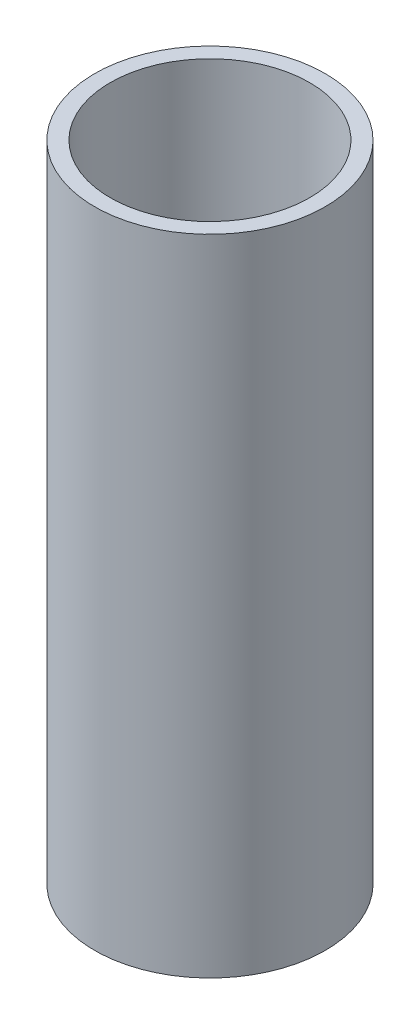
ISO-10303-21;
HEADER;
FILE_DESCRIPTION(('STEP AP214'),'2;1');
FILE_NAME('part.step','',(''),(''),'','','');
FILE_SCHEMA(('AUTOMOTIVE_DESIGN { 1 0 10303 214 1 1 1 1 }'));
ENDSEC;
DATA;
#1=APPLICATION_CONTEXT('core data for automotive mechanical design processes');
#2=APPLICATION_PROTOCOL_DEFINITION('international standard','automotive_design',2000,#1);
#3=PRODUCT_CONTEXT('',#1,'mechanical');
#4=PRODUCT('Part','Part','',(#3));
#5=PRODUCT_RELATED_PRODUCT_CATEGORY('part','',(#4));
#6=PRODUCT_DEFINITION_FORMATION('','',#4);
#7=PRODUCT_DEFINITION_CONTEXT('part definition',#1,'design');
#8=PRODUCT_DEFINITION('design','',#6,#7);
#9=PRODUCT_DEFINITION_SHAPE('','',#8);
#10=(LENGTH_UNIT() NAMED_UNIT(*) SI_UNIT(.MILLI.,.METRE.));
#11=(NAMED_UNIT(*) PLANE_ANGLE_UNIT() SI_UNIT($,.RADIAN.));
#12=(NAMED_UNIT(*) SI_UNIT($,.STERADIAN.) SOLID_ANGLE_UNIT());
#13=UNCERTAINTY_MEASURE_WITH_UNIT(LENGTH_MEASURE(1.E-05),#10,'distance_accuracy_value','');
#14=(GEOMETRIC_REPRESENTATION_CONTEXT(3) GLOBAL_UNCERTAINTY_ASSIGNED_CONTEXT((#13)) GLOBAL_UNIT_ASSIGNED_CONTEXT((#10,
#11,#12)) REPRESENTATION_CONTEXT('',''));
#15=CARTESIAN_POINT('',(0.,0.,0.));
#16=DIRECTION('',(0.,0.,1.));
#17=DIRECTION('',(1.,0.,0.));
#18=AXIS2_PLACEMENT_3D('',#15,#16,#17);
#19=CARTESIAN_POINT('',(0.,237.349167838291,0.));
#20=DIRECTION('',(0.,-1.,0.));
#21=DIRECTION('',(0.,0.,-1.));
#22=AXIS2_PLACEMENT_3D('',#19,#20,#21);
#23=CYLINDRICAL_SURFACE('',#22,42.5);
#24=CARTESIAN_POINT('',(0.,237.349167838291,0.));
#25=DIRECTION('',(0.,1.,0.));
#26=DIRECTION('',(0.,0.,1.));
#27=AXIS2_PLACEMENT_3D('',#24,#25,#26);
#28=CIRCLE('',#27,42.5);
#29=CARTESIAN_POINT('',(0.,237.34916783829,-42.5));
#30=VERTEX_POINT('',#29);
#31=EDGE_CURVE('E10',#30,#30,#28,.T.);
#32=CARTESIAN_POINT('',(0.,0.,0.));
#33=DIRECTION('',(0.,1.,0.));
#34=DIRECTION('',(0.,0.,1.));
#35=AXIS2_PLACEMENT_3D('',#32,#33,#34);
#36=CIRCLE('',#35,42.5);
#37=CARTESIAN_POINT('',(0.,0.,-42.5));
#38=VERTEX_POINT('',#37);
#39=EDGE_CURVE('E37',#38,#38,#36,.T.);
#40=CARTESIAN_POINT('',(0.,237.34916783829,-42.5));
#41=CARTESIAN_POINT('',(0.,234.876780673308,-42.5));
#42=CARTESIAN_POINT('',(0.,232.404393508326,-42.5));
#43=CARTESIAN_POINT('',(0.,227.459619178362,-42.5));
#44=CARTESIAN_POINT('',(0.,224.98723201338,-42.5));
#45=CARTESIAN_POINT('',(0.,220.042457683415,-42.5));
#46=CARTESIAN_POINT('',(0.,217.570070518433,-42.5));
#47=CARTESIAN_POINT('',(0.,212.625296188469,-42.5));
#48=CARTESIAN_POINT('',(0.,210.152909023486,-42.5));
#49=CARTESIAN_POINT('',(0.,205.208134693522,-42.5));
#50=CARTESIAN_POINT('',(0.,202.73574752854,-42.5));
#51=CARTESIAN_POINT('',(0.,197.790973198575,-42.5));
#52=CARTESIAN_POINT('',(0.,195.318586033593,-42.5));
#53=CARTESIAN_POINT('',(0.,190.373811703629,-42.5));
#54=CARTESIAN_POINT('',(0.,187.901424538647,-42.5));
#55=CARTESIAN_POINT('',(0.,182.956650208682,-42.5));
#56=CARTESIAN_POINT('',(0.,180.4842630437,-42.5));
#57=CARTESIAN_POINT('',(0.,175.539488713736,-42.5));
#58=CARTESIAN_POINT('',(0.,173.067101548753,-42.5));
#59=CARTESIAN_POINT('',(0.,168.122327218789,-42.5));
#60=CARTESIAN_POINT('',(0.,165.649940053807,-42.5));
#61=CARTESIAN_POINT('',(0.,160.705165723843,-42.5));
#62=CARTESIAN_POINT('',(0.,158.23277855886,-42.5));
#63=CARTESIAN_POINT('',(0.,153.288004228896,-42.5));
#64=CARTESIAN_POINT('',(0.,150.815617063914,-42.5));
#65=CARTESIAN_POINT('',(0.,145.870842733949,-42.5));
#66=CARTESIAN_POINT('',(0.,143.398455568967,-42.5));
#67=CARTESIAN_POINT('',(0.,138.453681239003,-42.5));
#68=CARTESIAN_POINT('',(0.,135.981294074021,-42.5));
#69=CARTESIAN_POINT('',(0.,131.036519744056,-42.5));
#70=CARTESIAN_POINT('',(0.,128.564132579074,-42.5));
#71=CARTESIAN_POINT('',(0.,123.61935824911,-42.5));
#72=CARTESIAN_POINT('',(0.,121.146971084127,-42.5));
#73=CARTESIAN_POINT('',(0.,116.202196754163,-42.5));
#74=CARTESIAN_POINT('',(0.,113.729809589181,-42.5));
#75=CARTESIAN_POINT('',(0.,108.785035259216,-42.5));
#76=CARTESIAN_POINT('',(0.,106.312648094234,-42.5));
#77=CARTESIAN_POINT('',(0.,101.36787376427,-42.5));
#78=CARTESIAN_POINT('',(0.,98.8954865992877,-42.5));
#79=CARTESIAN_POINT('',(0.,93.9507122693233,-42.5));
#80=CARTESIAN_POINT('',(0.,91.4783251043411,-42.5));
#81=CARTESIAN_POINT('',(0.,86.5335507743767,-42.5));
#82=CARTESIAN_POINT('',(0.,84.0611636093945,-42.5));
#83=CARTESIAN_POINT('',(0.,79.1163892794302,-42.5));
#84=CARTESIAN_POINT('',(0.,76.644002114448,-42.5));
#85=CARTESIAN_POINT('',(0.,71.6992277844836,-42.5));
#86=CARTESIAN_POINT('',(0.,69.2268406195014,-42.5));
#87=CARTESIAN_POINT('',(0.,64.282066289537,-42.5));
#88=CARTESIAN_POINT('',(0.,61.8096791245548,-42.5));
#89=CARTESIAN_POINT('',(0.,56.8649047945904,-42.5));
#90=CARTESIAN_POINT('',(0.,54.3925176296082,-42.5));
#91=CARTESIAN_POINT('',(0.,49.4477432996438,-42.5));
#92=CARTESIAN_POINT('',(0.,46.9753561346616,-42.5));
#93=CARTESIAN_POINT('',(0.,42.0305818046973,-42.5));
#94=CARTESIAN_POINT('',(0.,39.5581946397151,-42.5));
#95=CARTESIAN_POINT('',(0.,34.6134203097507,-42.5));
#96=CARTESIAN_POINT('',(0.,32.1410331447685,-42.5));
#97=CARTESIAN_POINT('',(0.,27.1962588148041,-42.5));
#98=CARTESIAN_POINT('',(0.,24.7238716498219,-42.5));
#99=CARTESIAN_POINT('',(0.,19.7790973198575,-42.5));
#100=CARTESIAN_POINT('',(0.,17.3067101548753,-42.5));
#101=CARTESIAN_POINT('',(0.,12.3619358249109,-42.5));
#102=CARTESIAN_POINT('',(0.,9.88954865992875,-42.5));
#103=CARTESIAN_POINT('',(0.,4.94477432996436,-42.5));
#104=CARTESIAN_POINT('',(0.,2.47238716498217,-42.5));
#105=CARTESIAN_POINT('',(0.,0.,-42.5));
#106=B_SPLINE_CURVE_WITH_KNOTS('',3,(#40,#41,#42,#43,#44,#45,#46,#47,#48,#49,#50,#51,#52,#53,
#54,#55,#56,#57,#58,#59,#60,#61,#62,#63,#64,#65,#66,#67,#68,#69,#70,#71,#72,#73,#74,#75,#76,#77,
#78,#79,#80,#81,#82,#83,#84,#85,#86,#87,#88,#89,#90,#91,#92,#93,#94,#95,#96,#97,#98,#99,#100,
#101,#102,#103,#104,#105),.UNSPECIFIED.,.F.,.F.,(4,2,2,2,2,2,2,2,2,2,2,2,2,2,2,2,2,2,2,2,2,2,2,
2,2,2,2,2,2,2,2,2,4),(0.,7.41716149494656,14.8343229898932,22.2514844848397,29.6686459797863,
37.0858074747329,44.5029689696795,51.920130464626,59.3372919595726,66.7544534545192,
74.1716149494657,81.5887764444123,89.0059379393589,96.4230994343055,103.840260929252,
111.257422424199,118.674583919145,126.091745414092,133.508906909038,140.926068403985,
148.343229898932,155.760391393878,163.177552888825,170.594714383771,178.011875878718,
185.429037373664,192.846198868611,200.263360363558,207.680521858504,215.097683353451,
222.514844848397,229.932006343344,237.349167838291),.UNSPECIFIED.);
#107=EDGE_CURVE('BSEAM40',#30,#38,#106,.T.);
#108=ORIENTED_EDGE('',*,*,#31,.F.);
#109=ORIENTED_EDGE('',*,*,#39,.T.);
#110=ORIENTED_EDGE('',*,*,#107,.T.);
#111=ORIENTED_EDGE('',*,*,#107,.F.);
#112=EDGE_LOOP('',(#108,#110,#109,#111));
#113=FACE_BOUND('',#112,.T.);
#114=ADVANCED_FACE('F40',(#113),#23,.T.);
#115=CARTESIAN_POINT('',(0.,237.349167838291,0.));
#116=DIRECTION('',(0.,1.,0.));
#117=DIRECTION('',(0.,0.,1.));
#118=AXIS2_PLACEMENT_3D('',#115,#116,#117);
#119=PLANE('',#118);
#120=CARTESIAN_POINT('',(0.,237.349167838291,0.));
#121=DIRECTION('',(0.,1.,0.));
#122=DIRECTION('',(0.,0.,1.));
#123=AXIS2_PLACEMENT_3D('',#120,#121,#122);
#124=CIRCLE('',#123,36.7560137630562);
#125=CARTESIAN_POINT('',(0.,237.34916783829,-36.7560137630562));
#126=VERTEX_POINT('',#125);
#127=EDGE_CURVE('E50',#126,#126,#124,.T.);
#128=ORIENTED_EDGE('',*,*,#127,.F.);
#129=EDGE_LOOP('',(#128));
#130=FACE_BOUND('',#129,.T.);
#131=ORIENTED_EDGE('',*,*,#31,.T.);
#132=EDGE_LOOP('',(#131));
#133=FACE_BOUND('',#132,.T.);
#134=ADVANCED_FACE('F59',(#130,#133),#119,.T.);
#135=CARTESIAN_POINT('',(0.,0.,0.));
#136=DIRECTION('',(0.,1.,0.));
#137=DIRECTION('',(0.,0.,1.));
#138=AXIS2_PLACEMENT_3D('',#135,#136,#137);
#139=PLANE('',#138);
#140=CARTESIAN_POINT('',(0.,0.,0.));
#141=DIRECTION('',(0.,1.,0.));
#142=DIRECTION('',(0.,0.,1.));
#143=AXIS2_PLACEMENT_3D('',#140,#141,#142);
#144=CIRCLE('',#143,36.7560137630562);
#145=CARTESIAN_POINT('',(0.,0.,-36.7560137630562));
#146=VERTEX_POINT('',#145);
#147=EDGE_CURVE('E47',#146,#146,#144,.T.);
#148=ORIENTED_EDGE('',*,*,#147,.T.);
#149=EDGE_LOOP('',(#148));
#150=FACE_BOUND('',#149,.T.);
#151=ORIENTED_EDGE('',*,*,#39,.F.);
#152=EDGE_LOOP('',(#151));
#153=FACE_BOUND('',#152,.T.);
#154=ADVANCED_FACE('F58',(#150,#153),#139,.F.);
#155=CARTESIAN_POINT('',(0.,237.349167838291,0.));
#156=DIRECTION('',(0.,-1.,0.));
#157=DIRECTION('',(0.,0.,-1.));
#158=AXIS2_PLACEMENT_3D('',#155,#156,#157);
#159=CYLINDRICAL_SURFACE('',#158,36.7560137630562);
#160=CARTESIAN_POINT('',(0.,237.34916783829,-36.7560137630562));
#161=CARTESIAN_POINT('',(0.,234.876780673308,-36.7560137630562));
#162=CARTESIAN_POINT('',(0.,232.404393508326,-36.7560137630562));
#163=CARTESIAN_POINT('',(0.,227.459619178362,-36.7560137630562));
#164=CARTESIAN_POINT('',(0.,224.98723201338,-36.7560137630562));
#165=CARTESIAN_POINT('',(0.,220.042457683415,-36.7560137630562));
#166=CARTESIAN_POINT('',(0.,217.570070518433,-36.7560137630562));
#167=CARTESIAN_POINT('',(0.,212.625296188469,-36.7560137630562));
#168=CARTESIAN_POINT('',(0.,210.152909023486,-36.7560137630562));
#169=CARTESIAN_POINT('',(0.,205.208134693522,-36.7560137630562));
#170=CARTESIAN_POINT('',(0.,202.73574752854,-36.7560137630562));
#171=CARTESIAN_POINT('',(0.,197.790973198575,-36.7560137630562));
#172=CARTESIAN_POINT('',(0.,195.318586033593,-36.7560137630562));
#173=CARTESIAN_POINT('',(0.,190.373811703629,-36.7560137630562));
#174=CARTESIAN_POINT('',(0.,187.901424538647,-36.7560137630562));
#175=CARTESIAN_POINT('',(0.,182.956650208682,-36.7560137630562));
#176=CARTESIAN_POINT('',(0.,180.4842630437,-36.7560137630562));
#177=CARTESIAN_POINT('',(0.,175.539488713736,-36.7560137630562));
#178=CARTESIAN_POINT('',(0.,173.067101548753,-36.7560137630562));
#179=CARTESIAN_POINT('',(0.,168.122327218789,-36.7560137630562));
#180=CARTESIAN_POINT('',(0.,165.649940053807,-36.7560137630562));
#181=CARTESIAN_POINT('',(0.,160.705165723843,-36.7560137630562));
#182=CARTESIAN_POINT('',(0.,158.23277855886,-36.7560137630562));
#183=CARTESIAN_POINT('',(0.,153.288004228896,-36.7560137630562));
#184=CARTESIAN_POINT('',(0.,150.815617063914,-36.7560137630562));
#185=CARTESIAN_POINT('',(0.,145.870842733949,-36.7560137630562));
#186=CARTESIAN_POINT('',(0.,143.398455568967,-36.7560137630562));
#187=CARTESIAN_POINT('',(0.,138.453681239003,-36.7560137630562));
#188=CARTESIAN_POINT('',(0.,135.981294074021,-36.7560137630562));
#189=CARTESIAN_POINT('',(0.,131.036519744056,-36.7560137630562));
#190=CARTESIAN_POINT('',(0.,128.564132579074,-36.7560137630562));
#191=CARTESIAN_POINT('',(0.,123.61935824911,-36.7560137630562));
#192=CARTESIAN_POINT('',(0.,121.146971084127,-36.7560137630562));
#193=CARTESIAN_POINT('',(0.,116.202196754163,-36.7560137630562));
#194=CARTESIAN_POINT('',(0.,113.729809589181,-36.7560137630562));
#195=CARTESIAN_POINT('',(0.,108.785035259216,-36.7560137630562));
#196=CARTESIAN_POINT('',(0.,106.312648094234,-36.7560137630562));
#197=CARTESIAN_POINT('',(0.,101.36787376427,-36.7560137630562));
#198=CARTESIAN_POINT('',(0.,98.8954865992877,-36.7560137630562));
#199=CARTESIAN_POINT('',(0.,93.9507122693233,-36.7560137630562));
#200=CARTESIAN_POINT('',(0.,91.4783251043411,-36.7560137630562));
#201=CARTESIAN_POINT('',(0.,86.5335507743767,-36.7560137630562));
#202=CARTESIAN_POINT('',(0.,84.0611636093945,-36.7560137630562));
#203=CARTESIAN_POINT('',(0.,79.1163892794302,-36.7560137630562));
#204=CARTESIAN_POINT('',(0.,76.644002114448,-36.7560137630562));
#205=CARTESIAN_POINT('',(0.,71.6992277844836,-36.7560137630562));
#206=CARTESIAN_POINT('',(0.,69.2268406195014,-36.7560137630562));
#207=CARTESIAN_POINT('',(0.,64.282066289537,-36.7560137630562));
#208=CARTESIAN_POINT('',(0.,61.8096791245548,-36.7560137630562));
#209=CARTESIAN_POINT('',(0.,56.8649047945904,-36.7560137630562));
#210=CARTESIAN_POINT('',(0.,54.3925176296082,-36.7560137630562));
#211=CARTESIAN_POINT('',(0.,49.4477432996438,-36.7560137630562));
#212=CARTESIAN_POINT('',(0.,46.9753561346616,-36.7560137630562));
#213=CARTESIAN_POINT('',(0.,42.0305818046973,-36.7560137630562));
#214=CARTESIAN_POINT('',(0.,39.5581946397151,-36.7560137630562));
#215=CARTESIAN_POINT('',(0.,34.6134203097507,-36.7560137630562));
#216=CARTESIAN_POINT('',(0.,32.1410331447685,-36.7560137630562));
#217=CARTESIAN_POINT('',(0.,27.1962588148041,-36.7560137630562));
#218=CARTESIAN_POINT('',(0.,24.7238716498219,-36.7560137630562));
#219=CARTESIAN_POINT('',(0.,19.7790973198575,-36.7560137630562));
#220=CARTESIAN_POINT('',(0.,17.3067101548753,-36.7560137630562));
#221=CARTESIAN_POINT('',(0.,12.3619358249109,-36.7560137630562));
#222=CARTESIAN_POINT('',(0.,9.88954865992875,-36.7560137630562));
#223=CARTESIAN_POINT('',(0.,4.94477432996436,-36.7560137630562));
#224=CARTESIAN_POINT('',(0.,2.47238716498217,-36.7560137630562));
#225=CARTESIAN_POINT('',(0.,0.,-36.7560137630562));
#226=B_SPLINE_CURVE_WITH_KNOTS('',3,(#160,#161,#162,#163,#164,#165,#166,#167,#168,#169,#170,
#171,#172,#173,#174,#175,#176,#177,#178,#179,#180,#181,#182,#183,#184,#185,#186,#187,#188,#189,
#190,#191,#192,#193,#194,#195,#196,#197,#198,#199,#200,#201,#202,#203,#204,#205,#206,#207,#208,
#209,#210,#211,#212,#213,#214,#215,#216,#217,#218,#219,#220,#221,#222,#223,#224,#225),
.UNSPECIFIED.,.F.,.F.,(4,2,2,2,2,2,2,2,2,2,2,2,2,2,2,2,2,2,2,2,2,2,2,2,2,2,2,2,2,2,2,2,4),(0.,
7.41716149494656,14.8343229898932,22.2514844848397,29.6686459797863,37.0858074747329,
44.5029689696795,51.920130464626,59.3372919595726,66.7544534545192,74.1716149494657,
81.5887764444123,89.0059379393589,96.4230994343055,103.840260929252,111.257422424199,
118.674583919145,126.091745414092,133.508906909038,140.926068403985,148.343229898932,
155.760391393878,163.177552888825,170.594714383771,178.011875878718,185.429037373664,
192.846198868611,200.263360363558,207.680521858504,215.097683353451,222.514844848397,
229.932006343344,237.349167838291),.UNSPECIFIED.);
#227=EDGE_CURVE('BSEAM54',#126,#146,#226,.T.);
#228=ORIENTED_EDGE('',*,*,#127,.T.);
#229=ORIENTED_EDGE('',*,*,#147,.F.);
#230=ORIENTED_EDGE('',*,*,#227,.T.);
#231=ORIENTED_EDGE('',*,*,#227,.F.);
#232=EDGE_LOOP('',(#228,#230,#229,#231));
#233=FACE_BOUND('',#232,.T.);
#234=ADVANCED_FACE('F54',(#233),#159,.F.);
#235=CLOSED_SHELL('',(#114,#134,#154,#234));
#236=MANIFOLD_SOLID_BREP('B2',#235);
#237=ADVANCED_BREP_SHAPE_REPRESENTATION('',(#18,#236),#14);
#238=SHAPE_DEFINITION_REPRESENTATION(#9,#237);
ENDSEC;
END-ISO-10303-21;
